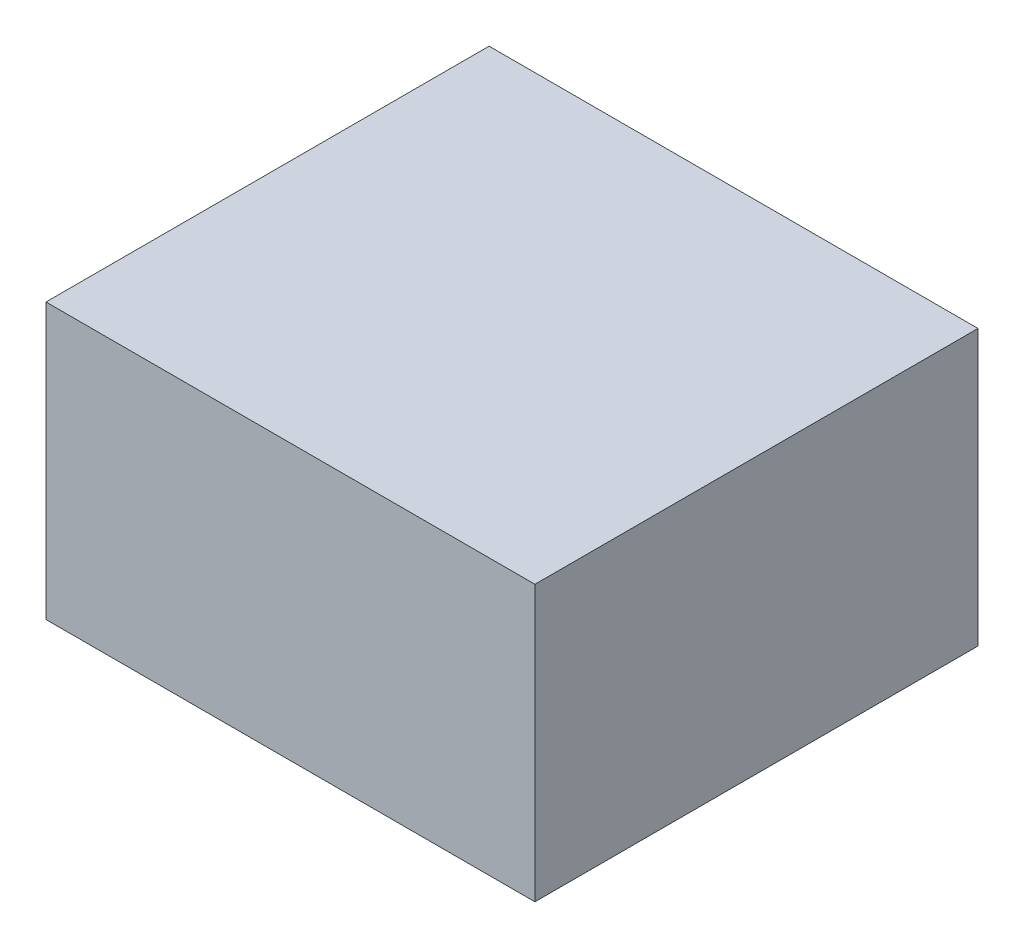
ISO-10303-21;
HEADER;
FILE_DESCRIPTION(('STEP AP214'),'2;1');
FILE_NAME('part.step','',(''),(''),'','','');
FILE_SCHEMA(('AUTOMOTIVE_DESIGN { 1 0 10303 214 1 1 1 1 }'));
ENDSEC;
DATA;
#1=APPLICATION_CONTEXT('core data for automotive mechanical design processes');
#2=APPLICATION_PROTOCOL_DEFINITION('international standard','automotive_design',2000,#1);
#3=PRODUCT_CONTEXT('',#1,'mechanical');
#4=PRODUCT('Part','Part','',(#3));
#5=PRODUCT_RELATED_PRODUCT_CATEGORY('part','',(#4));
#6=PRODUCT_DEFINITION_FORMATION('','',#4);
#7=PRODUCT_DEFINITION_CONTEXT('part definition',#1,'design');
#8=PRODUCT_DEFINITION('design','',#6,#7);
#9=PRODUCT_DEFINITION_SHAPE('','',#8);
#10=(LENGTH_UNIT() NAMED_UNIT(*) SI_UNIT(.MILLI.,.METRE.));
#11=(NAMED_UNIT(*) PLANE_ANGLE_UNIT() SI_UNIT($,.RADIAN.));
#12=(NAMED_UNIT(*) SI_UNIT($,.STERADIAN.) SOLID_ANGLE_UNIT());
#13=UNCERTAINTY_MEASURE_WITH_UNIT(LENGTH_MEASURE(1.E-05),#10,'distance_accuracy_value','');
#14=(GEOMETRIC_REPRESENTATION_CONTEXT(3) GLOBAL_UNCERTAINTY_ASSIGNED_CONTEXT((#13)) GLOBAL_UNIT_ASSIGNED_CONTEXT((#10,
#11,#12)) REPRESENTATION_CONTEXT('',''));
#15=CARTESIAN_POINT('',(0.,0.,0.));
#16=DIRECTION('',(0.,0.,1.));
#17=DIRECTION('',(1.,0.,0.));
#18=AXIS2_PLACEMENT_3D('',#15,#16,#17);
#19=CARTESIAN_POINT('',(50.8,57.15,-46.0375));
#20=DIRECTION('',(-1.,0.,0.));
#21=DIRECTION('',(0.,0.,1.));
#22=AXIS2_PLACEMENT_3D('',#19,#20,#21);
#23=PLANE('',#22);
#24=DIRECTION('',(0.,0.,-1.));
#25=VECTOR('',#24,1.);
#26=CARTESIAN_POINT('',(50.8,0.,-46.0375));
#27=LINE('',#26,#25);
#28=CARTESIAN_POINT('',(50.8,0.,46.0375));
#29=VERTEX_POINT('',#28);
#30=CARTESIAN_POINT('',(50.8,0.,-46.0375));
#31=VERTEX_POINT('',#30);
#32=EDGE_CURVE('E96',#29,#31,#27,.T.);
#33=ORIENTED_EDGE('',*,*,#32,.T.);
#34=DIRECTION('',(0.,-1.,0.));
#35=VECTOR('',#34,1.);
#36=CARTESIAN_POINT('',(50.8,57.15,-46.0375));
#37=LINE('',#36,#35);
#38=CARTESIAN_POINT('',(50.8,57.15,-46.0375));
#39=VERTEX_POINT('',#38);
#40=EDGE_CURVE('E11',#39,#31,#37,.T.);
#41=ORIENTED_EDGE('',*,*,#40,.F.);
#42=DIRECTION('',(0.,0.,-1.));
#43=VECTOR('',#42,1.);
#44=CARTESIAN_POINT('',(50.8,57.15,-46.0375));
#45=LINE('',#44,#43);
#46=CARTESIAN_POINT('',(50.8,57.15,46.0375));
#47=VERTEX_POINT('',#46);
#48=EDGE_CURVE('E84',#47,#39,#45,.T.);
#49=ORIENTED_EDGE('',*,*,#48,.F.);
#50=DIRECTION('',(0.,-1.,0.));
#51=VECTOR('',#50,1.);
#52=CARTESIAN_POINT('',(50.8,57.15,46.0375));
#53=LINE('',#52,#51);
#54=EDGE_CURVE('E92',#47,#29,#53,.T.);
#55=ORIENTED_EDGE('',*,*,#54,.T.);
#56=EDGE_LOOP('',(#33,#41,#49,#55));
#57=FACE_BOUND('',#56,.T.);
#58=ADVANCED_FACE('F33',(#57),#23,.F.);
#59=CARTESIAN_POINT('',(-50.8,57.15,-46.0375));
#60=DIRECTION('',(0.,0.,1.));
#61=DIRECTION('',(1.,0.,0.));
#62=AXIS2_PLACEMENT_3D('',#59,#60,#61);
#63=PLANE('',#62);
#64=DIRECTION('',(-1.,0.,0.));
#65=VECTOR('',#64,1.);
#66=CARTESIAN_POINT('',(-50.8,0.,-46.0375));
#67=LINE('',#66,#65);
#68=CARTESIAN_POINT('',(-50.8,0.,-46.0375));
#69=VERTEX_POINT('',#68);
#70=EDGE_CURVE('E88',#31,#69,#67,.T.);
#71=ORIENTED_EDGE('',*,*,#70,.T.);
#72=DIRECTION('',(0.,-1.,0.));
#73=VECTOR('',#72,1.);
#74=CARTESIAN_POINT('',(-50.8,57.15,-46.0375));
#75=LINE('',#74,#73);
#76=CARTESIAN_POINT('',(-50.8,57.15,-46.0375));
#77=VERTEX_POINT('',#76);
#78=EDGE_CURVE('E41',#77,#69,#75,.T.);
#79=ORIENTED_EDGE('',*,*,#78,.F.);
#80=DIRECTION('',(-1.,0.,0.));
#81=VECTOR('',#80,1.);
#82=CARTESIAN_POINT('',(-50.8,57.15,-46.0375));
#83=LINE('',#82,#81);
#84=EDGE_CURVE('E79',#39,#77,#83,.T.);
#85=ORIENTED_EDGE('',*,*,#84,.F.);
#86=ORIENTED_EDGE('',*,*,#40,.T.);
#87=EDGE_LOOP('',(#71,#79,#85,#86));
#88=FACE_BOUND('',#87,.T.);
#89=ADVANCED_FACE('F87',(#88),#63,.F.);
#90=CARTESIAN_POINT('',(-50.8,57.15,-46.0375));
#91=DIRECTION('',(1.,0.,0.));
#92=DIRECTION('',(0.,0.,-1.));
#93=AXIS2_PLACEMENT_3D('',#90,#91,#92);
#94=PLANE('',#93);
#95=DIRECTION('',(0.,0.,1.));
#96=VECTOR('',#95,1.);
#97=CARTESIAN_POINT('',(-50.8,0.,-46.0375));
#98=LINE('',#97,#96);
#99=CARTESIAN_POINT('',(-50.8,0.,46.0375));
#100=VERTEX_POINT('',#99);
#101=EDGE_CURVE('E66',#69,#100,#98,.T.);
#102=ORIENTED_EDGE('',*,*,#101,.T.);
#103=DIRECTION('',(0.,-1.,0.));
#104=VECTOR('',#103,1.);
#105=CARTESIAN_POINT('',(-50.8,57.15,46.0375));
#106=LINE('',#105,#104);
#107=CARTESIAN_POINT('',(-50.8,57.15,46.0375));
#108=VERTEX_POINT('',#107);
#109=EDGE_CURVE('E89',#108,#100,#106,.T.);
#110=ORIENTED_EDGE('',*,*,#109,.F.);
#111=DIRECTION('',(0.,0.,1.));
#112=VECTOR('',#111,1.);
#113=CARTESIAN_POINT('',(-50.8,57.15,-46.0375));
#114=LINE('',#113,#112);
#115=EDGE_CURVE('E82',#77,#108,#114,.T.);
#116=ORIENTED_EDGE('',*,*,#115,.F.);
#117=ORIENTED_EDGE('',*,*,#78,.T.);
#118=EDGE_LOOP('',(#102,#110,#116,#117));
#119=FACE_BOUND('',#118,.T.);
#120=ADVANCED_FACE('F90',(#119),#94,.F.);
#121=CARTESIAN_POINT('',(-50.8,57.15,46.0375));
#122=DIRECTION('',(0.,0.,-1.));
#123=DIRECTION('',(-1.,0.,0.));
#124=AXIS2_PLACEMENT_3D('',#121,#122,#123);
#125=PLANE('',#124);
#126=DIRECTION('',(1.,0.,0.));
#127=VECTOR('',#126,1.);
#128=CARTESIAN_POINT('',(-50.8,0.,46.0375));
#129=LINE('',#128,#127);
#130=EDGE_CURVE('E72',#100,#29,#129,.T.);
#131=ORIENTED_EDGE('',*,*,#130,.T.);
#132=ORIENTED_EDGE('',*,*,#54,.F.);
#133=DIRECTION('',(1.,0.,0.));
#134=VECTOR('',#133,1.);
#135=CARTESIAN_POINT('',(-50.8,57.15,46.0375));
#136=LINE('',#135,#134);
#137=EDGE_CURVE('E49',#108,#47,#136,.T.);
#138=ORIENTED_EDGE('',*,*,#137,.F.);
#139=ORIENTED_EDGE('',*,*,#109,.T.);
#140=EDGE_LOOP('',(#131,#132,#138,#139));
#141=FACE_BOUND('',#140,.T.);
#142=ADVANCED_FACE('F103',(#141),#125,.F.);
#143=CARTESIAN_POINT('',(0.,57.15,0.));
#144=DIRECTION('',(0.,1.,0.));
#145=DIRECTION('',(0.,0.,1.));
#146=AXIS2_PLACEMENT_3D('',#143,#144,#145);
#147=PLANE('',#146);
#148=ORIENTED_EDGE('',*,*,#48,.T.);
#149=ORIENTED_EDGE('',*,*,#84,.T.);
#150=ORIENTED_EDGE('',*,*,#115,.T.);
#151=ORIENTED_EDGE('',*,*,#137,.T.);
#152=EDGE_LOOP('',(#148,#149,#150,#151));
#153=FACE_BOUND('',#152,.T.);
#154=ADVANCED_FACE('F80',(#153),#147,.T.);
#155=CARTESIAN_POINT('',(0.,0.,0.));
#156=DIRECTION('',(0.,1.,0.));
#157=DIRECTION('',(0.,0.,1.));
#158=AXIS2_PLACEMENT_3D('',#155,#156,#157);
#159=PLANE('',#158);
#160=ORIENTED_EDGE('',*,*,#32,.F.);
#161=ORIENTED_EDGE('',*,*,#130,.F.);
#162=ORIENTED_EDGE('',*,*,#101,.F.);
#163=ORIENTED_EDGE('',*,*,#70,.F.);
#164=EDGE_LOOP('',(#160,#161,#162,#163));
#165=FACE_BOUND('',#164,.T.);
#166=ADVANCED_FACE('F106',(#165),#159,.F.);
#167=CLOSED_SHELL('',(#58,#89,#120,#142,#154,#166));
#168=MANIFOLD_SOLID_BREP('B2',#167);
#169=ADVANCED_BREP_SHAPE_REPRESENTATION('',(#18,#168),#14);
#170=SHAPE_DEFINITION_REPRESENTATION(#9,#169);
ENDSEC;
END-ISO-10303-21;
